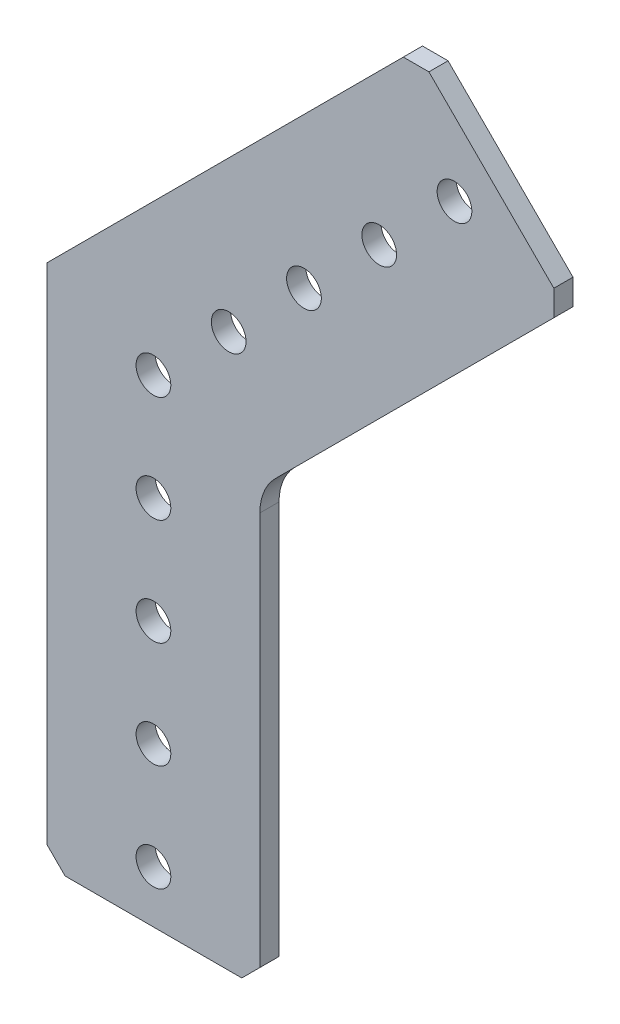
ISO-10303-21;
HEADER;
FILE_DESCRIPTION(('STEP AP214'),'2;1');
FILE_NAME('part.step','',(''),(''),'','','');
FILE_SCHEMA(('AUTOMOTIVE_DESIGN { 1 0 10303 214 1 1 1 1 }'));
ENDSEC;
DATA;
#1=APPLICATION_CONTEXT('core data for automotive mechanical design processes');
#2=APPLICATION_PROTOCOL_DEFINITION('international standard','automotive_design',2000,#1);
#3=PRODUCT_CONTEXT('',#1,'mechanical');
#4=PRODUCT('Part','Part','',(#3));
#5=PRODUCT_RELATED_PRODUCT_CATEGORY('part','',(#4));
#6=PRODUCT_DEFINITION_FORMATION('','',#4);
#7=PRODUCT_DEFINITION_CONTEXT('part definition',#1,'design');
#8=PRODUCT_DEFINITION('design','',#6,#7);
#9=PRODUCT_DEFINITION_SHAPE('','',#8);
#10=(LENGTH_UNIT() NAMED_UNIT(*) SI_UNIT(.MILLI.,.METRE.));
#11=(NAMED_UNIT(*) PLANE_ANGLE_UNIT() SI_UNIT($,.RADIAN.));
#12=(NAMED_UNIT(*) SI_UNIT($,.STERADIAN.) SOLID_ANGLE_UNIT());
#13=UNCERTAINTY_MEASURE_WITH_UNIT(LENGTH_MEASURE(1.E-05),#10,'distance_accuracy_value','');
#14=(GEOMETRIC_REPRESENTATION_CONTEXT(3) GLOBAL_UNCERTAINTY_ASSIGNED_CONTEXT((#13)) GLOBAL_UNIT_ASSIGNED_CONTEXT((#10,
#11,#12)) REPRESENTATION_CONTEXT('',''));
#15=CARTESIAN_POINT('',(0.,0.,0.));
#16=DIRECTION('',(0.,0.,1.));
#17=DIRECTION('',(1.,0.,0.));
#18=AXIS2_PLACEMENT_3D('',#15,#16,#17);
#19=CARTESIAN_POINT('',(47.7749625640879,32.8677374031131,0.));
#20=DIRECTION('',(0.707106781186547,0.707106781186548,0.));
#21=DIRECTION('',(-0.707106781186548,0.707106781186547,0.));
#22=AXIS2_PLACEMENT_3D('',#19,#20,#21);
#23=PLANE('',#22);
#24=DIRECTION('',(-0.707106781186548,0.707106781186547,0.));
#25=VECTOR('',#24,1.);
#26=CARTESIAN_POINT('',(47.7749625640879,32.8677374031131,2.286));
#27=LINE('',#26,#25);
#28=CARTESIAN_POINT('',(47.7749625640879,32.8677374031131,2.286));
#29=VERTEX_POINT('',#28);
#30=CARTESIAN_POINT('',(32.8677374031131,47.7749625640879,2.286));
#31=VERTEX_POINT('',#30);
#32=EDGE_CURVE('E147',#29,#31,#27,.T.);
#33=ORIENTED_EDGE('',*,*,#32,.F.);
#34=DIRECTION('',(0.,0.,1.));
#35=VECTOR('',#34,1.);
#36=CARTESIAN_POINT('',(47.7749625640879,32.8677374031131,0.));
#37=LINE('',#36,#35);
#38=CARTESIAN_POINT('',(47.7749625640879,32.8677374031131,0.));
#39=VERTEX_POINT('',#38);
#40=EDGE_CURVE('E11',#39,#29,#37,.T.);
#41=ORIENTED_EDGE('',*,*,#40,.F.);
#42=DIRECTION('',(-0.707106781186548,0.707106781186547,0.));
#43=VECTOR('',#42,1.);
#44=CARTESIAN_POINT('',(47.7749625640879,32.8677374031131,0.));
#45=LINE('',#44,#43);
#46=CARTESIAN_POINT('',(32.8677374031131,47.7749625640879,0.));
#47=VERTEX_POINT('',#46);
#48=EDGE_CURVE('E177',#39,#47,#45,.T.);
#49=ORIENTED_EDGE('',*,*,#48,.T.);
#50=DIRECTION('',(0.,0.,1.));
#51=VECTOR('',#50,1.);
#52=CARTESIAN_POINT('',(32.8677374031131,47.7749625640879,0.));
#53=LINE('',#52,#51);
#54=EDGE_CURVE('E35',#47,#31,#53,.T.);
#55=ORIENTED_EDGE('',*,*,#54,.T.);
#56=EDGE_LOOP('',(#33,#41,#49,#55));
#57=FACE_BOUND('',#56,.T.);
#58=ADVANCED_FACE('F32',(#57),#23,.T.);
#59=CARTESIAN_POINT('',(47.7749625640879,29.8144503219496,0.));
#60=DIRECTION('',(1.,0.,0.));
#61=DIRECTION('',(0.,1.,0.));
#62=AXIS2_PLACEMENT_3D('',#59,#60,#61);
#63=PLANE('',#62);
#64=DIRECTION('',(0.,1.,0.));
#65=VECTOR('',#64,1.);
#66=CARTESIAN_POINT('',(47.7749625640879,29.8144503219496,2.286));
#67=LINE('',#66,#65);
#68=CARTESIAN_POINT('',(47.7749625640879,29.8144503219496,2.286));
#69=VERTEX_POINT('',#68);
#70=EDGE_CURVE('E175',#69,#29,#67,.T.);
#71=ORIENTED_EDGE('',*,*,#70,.F.);
#72=DIRECTION('',(0.,0.,1.));
#73=VECTOR('',#72,1.);
#74=CARTESIAN_POINT('',(47.7749625640879,29.8144503219496,0.));
#75=LINE('',#74,#73);
#76=CARTESIAN_POINT('',(47.7749625640879,29.8144503219496,0.));
#77=VERTEX_POINT('',#76);
#78=EDGE_CURVE('E41',#77,#69,#75,.T.);
#79=ORIENTED_EDGE('',*,*,#78,.F.);
#80=DIRECTION('',(0.,1.,0.));
#81=VECTOR('',#80,1.);
#82=CARTESIAN_POINT('',(47.7749625640879,29.8144503219496,0.));
#83=LINE('',#82,#81);
#84=EDGE_CURVE('E137',#77,#39,#83,.T.);
#85=ORIENTED_EDGE('',*,*,#84,.T.);
#86=ORIENTED_EDGE('',*,*,#40,.T.);
#87=EDGE_LOOP('',(#71,#79,#85,#86));
#88=FACE_BOUND('',#87,.T.);
#89=ADVANCED_FACE('F195',(#88),#63,.T.);
#90=CARTESIAN_POINT('',(14.5598719394654,-3.40064030267288,0.));
#91=DIRECTION('',(0.707106781186548,-0.707106781186547,0.));
#92=DIRECTION('',(0.707106781186547,0.707106781186548,0.));
#93=AXIS2_PLACEMENT_3D('',#90,#91,#92);
#94=PLANE('',#93);
#95=DIRECTION('',(0.707106781186547,0.707106781186548,0.));
#96=VECTOR('',#95,1.);
#97=CARTESIAN_POINT('',(14.5598719394654,-3.40064030267288,2.286));
#98=LINE('',#97,#96);
#99=CARTESIAN_POINT('',(14.5598719394654,-3.40064030267288,2.286));
#100=VERTEX_POINT('',#99);
#101=EDGE_CURVE('E124',#100,#69,#98,.T.);
#102=ORIENTED_EDGE('',*,*,#101,.F.);
#103=DIRECTION('',(0.,0.,1.));
#104=VECTOR('',#103,1.);
#105=CARTESIAN_POINT('',(14.5598719394654,-3.40064030267288,0.));
#106=LINE('',#105,#104);
#107=CARTESIAN_POINT('',(14.5598719394654,-3.40064030267288,0.));
#108=VERTEX_POINT('',#107);
#109=EDGE_CURVE('E119',#108,#100,#106,.T.);
#110=ORIENTED_EDGE('',*,*,#109,.F.);
#111=DIRECTION('',(0.707106781186547,0.707106781186548,0.));
#112=VECTOR('',#111,1.);
#113=CARTESIAN_POINT('',(14.5598719394654,-3.40064030267288,0.));
#114=LINE('',#113,#112);
#115=EDGE_CURVE('E122',#108,#77,#114,.T.);
#116=ORIENTED_EDGE('',*,*,#115,.T.);
#117=ORIENTED_EDGE('',*,*,#78,.T.);
#118=EDGE_LOOP('',(#102,#110,#116,#117));
#119=FACE_BOUND('',#118,.T.);
#120=ADVANCED_FACE('F121',(#119),#94,.T.);
#121=CARTESIAN_POINT('',(19.05,-7.89076836320745,0.));
#122=DIRECTION('',(0.,0.,1.));
#123=DIRECTION('',(1.,0.,0.));
#124=AXIS2_PLACEMENT_3D('',#121,#122,#123);
#125=CYLINDRICAL_SURFACE('',#124,6.35);
#126=CARTESIAN_POINT('',(19.05,-7.89076836320745,2.286));
#127=DIRECTION('',(0.,0.,-1.));
#128=DIRECTION('',(-1.,0.,0.));
#129=AXIS2_PLACEMENT_3D('',#126,#127,#128);
#130=CIRCLE('',#129,6.35);
#131=CARTESIAN_POINT('',(12.7,-7.89076836320745,2.286));
#132=VERTEX_POINT('',#131);
#133=EDGE_CURVE('E172',#132,#100,#130,.T.);
#134=ORIENTED_EDGE('',*,*,#133,.F.);
#135=DIRECTION('',(0.,0.,1.));
#136=VECTOR('',#135,1.);
#137=CARTESIAN_POINT('',(12.7,-7.89076836320745,0.));
#138=LINE('',#137,#136);
#139=CARTESIAN_POINT('',(12.7,-7.89076836320745,0.));
#140=VERTEX_POINT('',#139);
#141=EDGE_CURVE('E129',#140,#132,#138,.T.);
#142=ORIENTED_EDGE('',*,*,#141,.F.);
#143=CARTESIAN_POINT('',(19.05,-7.89076836320745,0.));
#144=DIRECTION('',(0.,0.,-1.));
#145=DIRECTION('',(-1.,0.,0.));
#146=AXIS2_PLACEMENT_3D('',#143,#144,#145);
#147=CIRCLE('',#146,6.35);
#148=EDGE_CURVE('E135',#140,#108,#147,.T.);
#149=ORIENTED_EDGE('',*,*,#148,.T.);
#150=ORIENTED_EDGE('',*,*,#109,.T.);
#151=EDGE_LOOP('',(#134,#142,#149,#150));
#152=FACE_BOUND('',#151,.T.);
#153=ADVANCED_FACE('F139',(#152),#125,.F.);
#154=CARTESIAN_POINT('',(12.7,-54.864,0.));
#155=DIRECTION('',(1.,0.,0.));
#156=DIRECTION('',(0.,1.,0.));
#157=AXIS2_PLACEMENT_3D('',#154,#155,#156);
#158=PLANE('',#157);
#159=DIRECTION('',(0.,1.,0.));
#160=VECTOR('',#159,1.);
#161=CARTESIAN_POINT('',(12.7,-54.864,2.286));
#162=LINE('',#161,#160);
#163=CARTESIAN_POINT('',(12.7,-54.864,2.286));
#164=VERTEX_POINT('',#163);
#165=EDGE_CURVE('E169',#164,#132,#162,.T.);
#166=ORIENTED_EDGE('',*,*,#165,.F.);
#167=DIRECTION('',(0.,0.,1.));
#168=VECTOR('',#167,1.);
#169=CARTESIAN_POINT('',(12.7,-54.864,0.));
#170=LINE('',#169,#168);
#171=CARTESIAN_POINT('',(12.7,-54.864,0.));
#172=VERTEX_POINT('',#171);
#173=EDGE_CURVE('E181',#172,#164,#170,.T.);
#174=ORIENTED_EDGE('',*,*,#173,.F.);
#175=DIRECTION('',(0.,1.,0.));
#176=VECTOR('',#175,1.);
#177=CARTESIAN_POINT('',(12.7,-54.864,0.));
#178=LINE('',#177,#176);
#179=EDGE_CURVE('E140',#172,#140,#178,.T.);
#180=ORIENTED_EDGE('',*,*,#179,.T.);
#181=ORIENTED_EDGE('',*,*,#141,.T.);
#182=EDGE_LOOP('',(#166,#174,#180,#181));
#183=FACE_BOUND('',#182,.T.);
#184=ADVANCED_FACE('F208',(#183),#158,.T.);
#185=CARTESIAN_POINT('',(10.541,-57.023,0.));
#186=DIRECTION('',(0.70710678118655,-0.707106781186545,0.));
#187=DIRECTION('',(0.707106781186545,0.70710678118655,0.));
#188=AXIS2_PLACEMENT_3D('',#185,#186,#187);
#189=PLANE('',#188);
#190=DIRECTION('',(0.707106781186545,0.70710678118655,0.));
#191=VECTOR('',#190,1.);
#192=CARTESIAN_POINT('',(10.541,-57.023,2.286));
#193=LINE('',#192,#191);
#194=CARTESIAN_POINT('',(10.541,-57.023,2.286));
#195=VERTEX_POINT('',#194);
#196=EDGE_CURVE('E166',#195,#164,#193,.T.);
#197=ORIENTED_EDGE('',*,*,#196,.F.);
#198=DIRECTION('',(0.,0.,1.));
#199=VECTOR('',#198,1.);
#200=CARTESIAN_POINT('',(10.541,-57.023,0.));
#201=LINE('',#200,#199);
#202=CARTESIAN_POINT('',(10.541,-57.023,0.));
#203=VERTEX_POINT('',#202);
#204=EDGE_CURVE('E183',#203,#195,#201,.T.);
#205=ORIENTED_EDGE('',*,*,#204,.F.);
#206=DIRECTION('',(0.707106781186545,0.70710678118655,0.));
#207=VECTOR('',#206,1.);
#208=CARTESIAN_POINT('',(10.541,-57.023,0.));
#209=LINE('',#208,#207);
#210=EDGE_CURVE('E142',#203,#172,#209,.T.);
#211=ORIENTED_EDGE('',*,*,#210,.T.);
#212=ORIENTED_EDGE('',*,*,#173,.T.);
#213=EDGE_LOOP('',(#197,#205,#211,#212));
#214=FACE_BOUND('',#213,.T.);
#215=ADVANCED_FACE('F211',(#214),#189,.T.);
#216=CARTESIAN_POINT('',(-10.541,-57.023,0.));
#217=DIRECTION('',(0.,-1.,0.));
#218=DIRECTION('',(1.,0.,0.));
#219=AXIS2_PLACEMENT_3D('',#216,#217,#218);
#220=PLANE('',#219);
#221=DIRECTION('',(1.,0.,0.));
#222=VECTOR('',#221,1.);
#223=CARTESIAN_POINT('',(-10.541,-57.023,2.286));
#224=LINE('',#223,#222);
#225=CARTESIAN_POINT('',(-10.541,-57.023,2.286));
#226=VERTEX_POINT('',#225);
#227=EDGE_CURVE('E163',#226,#195,#224,.T.);
#228=ORIENTED_EDGE('',*,*,#227,.F.);
#229=DIRECTION('',(0.,0.,1.));
#230=VECTOR('',#229,1.);
#231=CARTESIAN_POINT('',(-10.541,-57.023,0.));
#232=LINE('',#231,#230);
#233=CARTESIAN_POINT('',(-10.541,-57.023,0.));
#234=VERTEX_POINT('',#233);
#235=EDGE_CURVE('E185',#234,#226,#232,.T.);
#236=ORIENTED_EDGE('',*,*,#235,.F.);
#237=DIRECTION('',(1.,0.,0.));
#238=VECTOR('',#237,1.);
#239=CARTESIAN_POINT('',(-10.541,-57.023,0.));
#240=LINE('',#239,#238);
#241=EDGE_CURVE('E348',#234,#203,#240,.T.);
#242=ORIENTED_EDGE('',*,*,#241,.T.);
#243=ORIENTED_EDGE('',*,*,#204,.T.);
#244=EDGE_LOOP('',(#228,#236,#242,#243));
#245=FACE_BOUND('',#244,.T.);
#246=ADVANCED_FACE('F215',(#245),#220,.T.);
#247=CARTESIAN_POINT('',(-12.7,-54.864,0.));
#248=DIRECTION('',(-0.707106781186549,-0.707106781186546,0.));
#249=DIRECTION('',(0.707106781186546,-0.707106781186549,0.));
#250=AXIS2_PLACEMENT_3D('',#247,#248,#249);
#251=PLANE('',#250);
#252=DIRECTION('',(0.707106781186546,-0.707106781186549,0.));
#253=VECTOR('',#252,1.);
#254=CARTESIAN_POINT('',(-12.7,-54.864,2.286));
#255=LINE('',#254,#253);
#256=CARTESIAN_POINT('',(-12.7,-54.864,2.286));
#257=VERTEX_POINT('',#256);
#258=EDGE_CURVE('E160',#257,#226,#255,.T.);
#259=ORIENTED_EDGE('',*,*,#258,.F.);
#260=DIRECTION('',(0.,0.,1.));
#261=VECTOR('',#260,1.);
#262=CARTESIAN_POINT('',(-12.7,-54.864,0.));
#263=LINE('',#262,#261);
#264=CARTESIAN_POINT('',(-12.7,-54.864,0.));
#265=VERTEX_POINT('',#264);
#266=EDGE_CURVE('E187',#265,#257,#263,.T.);
#267=ORIENTED_EDGE('',*,*,#266,.F.);
#268=DIRECTION('',(0.707106781186546,-0.707106781186549,0.));
#269=VECTOR('',#268,1.);
#270=CARTESIAN_POINT('',(-12.7,-54.864,0.));
#271=LINE('',#270,#269);
#272=EDGE_CURVE('E345',#265,#234,#271,.T.);
#273=ORIENTED_EDGE('',*,*,#272,.T.);
#274=ORIENTED_EDGE('',*,*,#235,.T.);
#275=EDGE_LOOP('',(#259,#267,#273,#274));
#276=FACE_BOUND('',#275,.T.);
#277=ADVANCED_FACE('F219',(#276),#251,.T.);
#278=CARTESIAN_POINT('',(-12.7,5.26051224213831,0.));
#279=DIRECTION('',(-1.,0.,0.));
#280=DIRECTION('',(0.,0.,1.));
#281=AXIS2_PLACEMENT_3D('',#278,#279,#280);
#282=PLANE('',#281);
#283=DIRECTION('',(0.,-1.,0.));
#284=VECTOR('',#283,1.);
#285=CARTESIAN_POINT('',(-12.7,5.26051224213831,2.286));
#286=LINE('',#285,#284);
#287=CARTESIAN_POINT('',(-12.7,5.26051224213831,2.286));
#288=VERTEX_POINT('',#287);
#289=EDGE_CURVE('E157',#288,#257,#286,.T.);
#290=ORIENTED_EDGE('',*,*,#289,.F.);
#291=DIRECTION('',(0.,0.,1.));
#292=VECTOR('',#291,1.);
#293=CARTESIAN_POINT('',(-12.7,5.26051224213831,0.));
#294=LINE('',#293,#292);
#295=CARTESIAN_POINT('',(-12.7,5.26051224213831,0.));
#296=VERTEX_POINT('',#295);
#297=EDGE_CURVE('E189',#296,#288,#294,.T.);
#298=ORIENTED_EDGE('',*,*,#297,.F.);
#299=DIRECTION('',(0.,-1.,0.));
#300=VECTOR('',#299,1.);
#301=CARTESIAN_POINT('',(-12.7,5.26051224213831,0.));
#302=LINE('',#301,#300);
#303=EDGE_CURVE('E342',#296,#265,#302,.T.);
#304=ORIENTED_EDGE('',*,*,#303,.T.);
#305=ORIENTED_EDGE('',*,*,#266,.T.);
#306=EDGE_LOOP('',(#290,#298,#304,#305));
#307=FACE_BOUND('',#306,.T.);
#308=ADVANCED_FACE('F223',(#307),#282,.T.);
#309=CARTESIAN_POINT('',(29.8144503219496,47.7749625640879,0.));
#310=DIRECTION('',(-0.707106781186548,0.707106781186547,0.));
#311=DIRECTION('',(-0.707106781186547,-0.707106781186548,0.));
#312=AXIS2_PLACEMENT_3D('',#309,#310,#311);
#313=PLANE('',#312);
#314=DIRECTION('',(-0.707106781186547,-0.707106781186548,0.));
#315=VECTOR('',#314,1.);
#316=CARTESIAN_POINT('',(29.8144503219496,47.7749625640879,2.286));
#317=LINE('',#316,#315);
#318=CARTESIAN_POINT('',(29.8144503219496,47.7749625640879,2.286));
#319=VERTEX_POINT('',#318);
#320=EDGE_CURVE('E154',#319,#288,#317,.T.);
#321=ORIENTED_EDGE('',*,*,#320,.F.);
#322=DIRECTION('',(0.,0.,1.));
#323=VECTOR('',#322,1.);
#324=CARTESIAN_POINT('',(29.8144503219496,47.7749625640879,0.));
#325=LINE('',#324,#323);
#326=CARTESIAN_POINT('',(29.8144503219496,47.7749625640879,0.));
#327=VERTEX_POINT('',#326);
#328=EDGE_CURVE('E190',#327,#319,#325,.T.);
#329=ORIENTED_EDGE('',*,*,#328,.F.);
#330=DIRECTION('',(-0.707106781186547,-0.707106781186548,0.));
#331=VECTOR('',#330,1.);
#332=CARTESIAN_POINT('',(29.8144503219496,47.7749625640879,0.));
#333=LINE('',#332,#331);
#334=EDGE_CURVE('E339',#327,#296,#333,.T.);
#335=ORIENTED_EDGE('',*,*,#334,.T.);
#336=ORIENTED_EDGE('',*,*,#297,.T.);
#337=EDGE_LOOP('',(#321,#329,#335,#336));
#338=FACE_BOUND('',#337,.T.);
#339=ADVANCED_FACE('F227',(#338),#313,.T.);
#340=CARTESIAN_POINT('',(32.8677374031131,47.7749625640879,0.));
#341=DIRECTION('',(0.,1.,0.));
#342=DIRECTION('',(0.,0.,1.));
#343=AXIS2_PLACEMENT_3D('',#340,#341,#342);
#344=PLANE('',#343);
#345=DIRECTION('',(-1.,0.,0.));
#346=VECTOR('',#345,1.);
#347=CARTESIAN_POINT('',(32.8677374031131,47.7749625640879,2.286));
#348=LINE('',#347,#346);
#349=EDGE_CURVE('E150',#31,#319,#348,.T.);
#350=ORIENTED_EDGE('',*,*,#349,.F.);
#351=ORIENTED_EDGE('',*,*,#54,.F.);
#352=DIRECTION('',(-1.,0.,0.));
#353=VECTOR('',#352,1.);
#354=CARTESIAN_POINT('',(32.8677374031131,47.7749625640879,0.));
#355=LINE('',#354,#353);
#356=EDGE_CURVE('E337',#47,#327,#355,.T.);
#357=ORIENTED_EDGE('',*,*,#356,.T.);
#358=ORIENTED_EDGE('',*,*,#328,.T.);
#359=EDGE_LOOP('',(#350,#351,#357,#358));
#360=FACE_BOUND('',#359,.T.);
#361=ADVANCED_FACE('F192',(#360),#344,.T.);
#362=CARTESIAN_POINT('',(19.05,-7.89076836320745,0.));
#363=DIRECTION('',(0.,0.,-1.));
#364=DIRECTION('',(-1.,0.,0.));
#365=AXIS2_PLACEMENT_3D('',#362,#363,#364);
#366=PLANE('',#365);
#367=CARTESIAN_POINT('',(0.,0.,0.));
#368=DIRECTION('',(0.,0.,1.));
#369=DIRECTION('',(-1.,0.,0.));
#370=AXIS2_PLACEMENT_3D('',#367,#368,#369);
#371=CIRCLE('',#370,2.0701);
#372=CARTESIAN_POINT('',(-2.0701,0.,0.));
#373=VERTEX_POINT('',#372);
#374=EDGE_CURVE('E282',#373,#373,#371,.T.);
#375=ORIENTED_EDGE('',*,*,#374,.T.);
#376=EDGE_LOOP('',(#375));
#377=FACE_BOUND('',#376,.T.);
#378=CARTESIAN_POINT('',(3.9907631702977E-13,-38.1,0.));
#379=DIRECTION('',(0.,0.,1.));
#380=DIRECTION('',(-1.,0.,0.));
#381=AXIS2_PLACEMENT_3D('',#378,#379,#380);
#382=CIRCLE('',#381,2.0701);
#383=CARTESIAN_POINT('',(-2.0700999999996,-38.1,0.));
#384=VERTEX_POINT('',#383);
#385=EDGE_CURVE('E290',#384,#384,#382,.T.);
#386=ORIENTED_EDGE('',*,*,#385,.T.);
#387=EDGE_LOOP('',(#386));
#388=FACE_BOUND('',#387,.T.);
#389=CARTESIAN_POINT('',(1.33025439009923E-13,-12.7,0.));
#390=DIRECTION('',(0.,0.,1.));
#391=DIRECTION('',(-1.,0.,0.));
#392=AXIS2_PLACEMENT_3D('',#389,#390,#391);
#393=CIRCLE('',#392,2.0701);
#394=CARTESIAN_POINT('',(-2.07009999999987,-12.7,0.));
#395=VERTEX_POINT('',#394);
#396=EDGE_CURVE('E296',#395,#395,#393,.T.);
#397=ORIENTED_EDGE('',*,*,#396,.T.);
#398=EDGE_LOOP('',(#397));
#399=FACE_BOUND('',#398,.T.);
#400=CARTESIAN_POINT('',(2.66050878019847E-13,-25.4,0.));
#401=DIRECTION('',(0.,0.,1.));
#402=DIRECTION('',(-1.,0.,0.));
#403=AXIS2_PLACEMENT_3D('',#400,#401,#402);
#404=CIRCLE('',#403,2.0701);
#405=CARTESIAN_POINT('',(-2.07009999999973,-25.4,0.));
#406=VERTEX_POINT('',#405);
#407=EDGE_CURVE('E302',#406,#406,#404,.T.);
#408=ORIENTED_EDGE('',*,*,#407,.T.);
#409=EDGE_LOOP('',(#408));
#410=FACE_BOUND('',#409,.T.);
#411=CARTESIAN_POINT('',(0.,-50.8,0.));
#412=DIRECTION('',(0.,0.,1.));
#413=DIRECTION('',(-1.,0.,0.));
#414=AXIS2_PLACEMENT_3D('',#411,#412,#413);
#415=CIRCLE('',#414,2.0701);
#416=CARTESIAN_POINT('',(-2.07009999999999,-50.8,0.));
#417=VERTEX_POINT('',#416);
#418=EDGE_CURVE('E308',#417,#417,#415,.T.);
#419=ORIENTED_EDGE('',*,*,#418,.T.);
#420=EDGE_LOOP('',(#419));
#421=FACE_BOUND('',#420,.T.);
#422=CARTESIAN_POINT('',(26.9407683632077,26.9407683632072,0.));
#423=DIRECTION('',(0.,0.,1.));
#424=DIRECTION('',(-1.,0.,0.));
#425=AXIS2_PLACEMENT_3D('',#422,#423,#424);
#426=CIRCLE('',#425,2.0701);
#427=CARTESIAN_POINT('',(24.8706683632077,26.9407683632072,0.));
#428=VERTEX_POINT('',#427);
#429=EDGE_CURVE('E314',#428,#428,#426,.T.);
#430=ORIENTED_EDGE('',*,*,#429,.T.);
#431=EDGE_LOOP('',(#430));
#432=FACE_BOUND('',#431,.T.);
#433=CARTESIAN_POINT('',(8.98025612106925,8.98025612106906,0.));
#434=DIRECTION('',(0.,0.,1.));
#435=DIRECTION('',(-1.,0.,0.));
#436=AXIS2_PLACEMENT_3D('',#433,#434,#435);
#437=CIRCLE('',#436,2.0701);
#438=CARTESIAN_POINT('',(6.91015612106925,8.98025612106906,0.));
#439=VERTEX_POINT('',#438);
#440=EDGE_CURVE('E320',#439,#439,#437,.T.);
#441=ORIENTED_EDGE('',*,*,#440,.T.);
#442=EDGE_LOOP('',(#441));
#443=FACE_BOUND('',#442,.T.);
#444=CARTESIAN_POINT('',(17.9605122421385,17.9605122421381,0.));
#445=DIRECTION('',(0.,0.,1.));
#446=DIRECTION('',(-1.,0.,0.));
#447=AXIS2_PLACEMENT_3D('',#444,#445,#446);
#448=CIRCLE('',#447,2.0701);
#449=CARTESIAN_POINT('',(15.8904122421385,17.9605122421381,0.));
#450=VERTEX_POINT('',#449);
#451=EDGE_CURVE('E326',#450,#450,#448,.T.);
#452=ORIENTED_EDGE('',*,*,#451,.T.);
#453=EDGE_LOOP('',(#452));
#454=FACE_BOUND('',#453,.T.);
#455=CARTESIAN_POINT('',(35.9210244842766,35.9210244842766,0.));
#456=DIRECTION('',(0.,0.,1.));
#457=DIRECTION('',(-1.,0.,0.));
#458=AXIS2_PLACEMENT_3D('',#455,#456,#457);
#459=CIRCLE('',#458,2.07010000000001);
#460=CARTESIAN_POINT('',(33.8509244842766,35.9210244842766,0.));
#461=VERTEX_POINT('',#460);
#462=EDGE_CURVE('E151',#461,#461,#459,.T.);
#463=ORIENTED_EDGE('',*,*,#462,.T.);
#464=EDGE_LOOP('',(#463));
#465=FACE_BOUND('',#464,.T.);
#466=ORIENTED_EDGE('',*,*,#48,.F.);
#467=ORIENTED_EDGE('',*,*,#84,.F.);
#468=ORIENTED_EDGE('',*,*,#115,.F.);
#469=ORIENTED_EDGE('',*,*,#148,.F.);
#470=ORIENTED_EDGE('',*,*,#179,.F.);
#471=ORIENTED_EDGE('',*,*,#210,.F.);
#472=ORIENTED_EDGE('',*,*,#241,.F.);
#473=ORIENTED_EDGE('',*,*,#272,.F.);
#474=ORIENTED_EDGE('',*,*,#303,.F.);
#475=ORIENTED_EDGE('',*,*,#334,.F.);
#476=ORIENTED_EDGE('',*,*,#356,.F.);
#477=EDGE_LOOP('',(#466,#467,#468,#469,#470,#471,#472,#473,#474,#475,#476));
#478=FACE_BOUND('',#477,.T.);
#479=ADVANCED_FACE('F133',(#377,#388,#399,#410,#421,#432,#443,#454,#465,#478),#366,.T.);
#480=CARTESIAN_POINT('',(19.05,-7.89076836320745,2.286));
#481=DIRECTION('',(0.,0.,-1.));
#482=DIRECTION('',(-1.,0.,0.));
#483=AXIS2_PLACEMENT_3D('',#480,#481,#482);
#484=PLANE('',#483);
#485=CARTESIAN_POINT('',(0.,0.,2.286));
#486=DIRECTION('',(0.,0.,1.));
#487=DIRECTION('',(-1.,0.,0.));
#488=AXIS2_PLACEMENT_3D('',#485,#486,#487);
#489=CIRCLE('',#488,2.0701);
#490=CARTESIAN_POINT('',(-2.0701,0.,2.286));
#491=VERTEX_POINT('',#490);
#492=EDGE_CURVE('E285',#491,#491,#489,.T.);
#493=ORIENTED_EDGE('',*,*,#492,.F.);
#494=EDGE_LOOP('',(#493));
#495=FACE_BOUND('',#494,.T.);
#496=CARTESIAN_POINT('',(3.9907631702977E-13,-38.1,2.286));
#497=DIRECTION('',(0.,0.,1.));
#498=DIRECTION('',(-1.,0.,0.));
#499=AXIS2_PLACEMENT_3D('',#496,#497,#498);
#500=CIRCLE('',#499,2.0701);
#501=CARTESIAN_POINT('',(-2.0700999999996,-38.1,2.286));
#502=VERTEX_POINT('',#501);
#503=EDGE_CURVE('E287',#502,#502,#500,.T.);
#504=ORIENTED_EDGE('',*,*,#503,.F.);
#505=EDGE_LOOP('',(#504));
#506=FACE_BOUND('',#505,.T.);
#507=CARTESIAN_POINT('',(1.33025439009923E-13,-12.7,2.286));
#508=DIRECTION('',(0.,0.,1.));
#509=DIRECTION('',(-1.,0.,0.));
#510=AXIS2_PLACEMENT_3D('',#507,#508,#509);
#511=CIRCLE('',#510,2.0701);
#512=CARTESIAN_POINT('',(-2.07009999999987,-12.7,2.286));
#513=VERTEX_POINT('',#512);
#514=EDGE_CURVE('E293',#513,#513,#511,.T.);
#515=ORIENTED_EDGE('',*,*,#514,.F.);
#516=EDGE_LOOP('',(#515));
#517=FACE_BOUND('',#516,.T.);
#518=CARTESIAN_POINT('',(2.66050878019847E-13,-25.4,2.286));
#519=DIRECTION('',(0.,0.,1.));
#520=DIRECTION('',(-1.,0.,0.));
#521=AXIS2_PLACEMENT_3D('',#518,#519,#520);
#522=CIRCLE('',#521,2.0701);
#523=CARTESIAN_POINT('',(-2.07009999999973,-25.4,2.286));
#524=VERTEX_POINT('',#523);
#525=EDGE_CURVE('E299',#524,#524,#522,.T.);
#526=ORIENTED_EDGE('',*,*,#525,.F.);
#527=EDGE_LOOP('',(#526));
#528=FACE_BOUND('',#527,.T.);
#529=CARTESIAN_POINT('',(0.,-50.8,2.286));
#530=DIRECTION('',(0.,0.,1.));
#531=DIRECTION('',(-1.,0.,0.));
#532=AXIS2_PLACEMENT_3D('',#529,#530,#531);
#533=CIRCLE('',#532,2.0701);
#534=CARTESIAN_POINT('',(-2.07009999999999,-50.8,2.286));
#535=VERTEX_POINT('',#534);
#536=EDGE_CURVE('E305',#535,#535,#533,.T.);
#537=ORIENTED_EDGE('',*,*,#536,.F.);
#538=EDGE_LOOP('',(#537));
#539=FACE_BOUND('',#538,.T.);
#540=CARTESIAN_POINT('',(26.9407683632077,26.9407683632072,2.286));
#541=DIRECTION('',(0.,0.,1.));
#542=DIRECTION('',(-1.,0.,0.));
#543=AXIS2_PLACEMENT_3D('',#540,#541,#542);
#544=CIRCLE('',#543,2.0701);
#545=CARTESIAN_POINT('',(24.8706683632077,26.9407683632072,2.286));
#546=VERTEX_POINT('',#545);
#547=EDGE_CURVE('E311',#546,#546,#544,.T.);
#548=ORIENTED_EDGE('',*,*,#547,.F.);
#549=EDGE_LOOP('',(#548));
#550=FACE_BOUND('',#549,.T.);
#551=CARTESIAN_POINT('',(8.98025612106925,8.98025612106906,2.286));
#552=DIRECTION('',(0.,0.,1.));
#553=DIRECTION('',(-1.,0.,0.));
#554=AXIS2_PLACEMENT_3D('',#551,#552,#553);
#555=CIRCLE('',#554,2.0701);
#556=CARTESIAN_POINT('',(6.91015612106925,8.98025612106906,2.286));
#557=VERTEX_POINT('',#556);
#558=EDGE_CURVE('E317',#557,#557,#555,.T.);
#559=ORIENTED_EDGE('',*,*,#558,.F.);
#560=EDGE_LOOP('',(#559));
#561=FACE_BOUND('',#560,.T.);
#562=CARTESIAN_POINT('',(17.9605122421385,17.9605122421381,2.286));
#563=DIRECTION('',(0.,0.,1.));
#564=DIRECTION('',(-1.,0.,0.));
#565=AXIS2_PLACEMENT_3D('',#562,#563,#564);
#566=CIRCLE('',#565,2.0701);
#567=CARTESIAN_POINT('',(15.8904122421385,17.9605122421381,2.286));
#568=VERTEX_POINT('',#567);
#569=EDGE_CURVE('E323',#568,#568,#566,.T.);
#570=ORIENTED_EDGE('',*,*,#569,.F.);
#571=EDGE_LOOP('',(#570));
#572=FACE_BOUND('',#571,.T.);
#573=CARTESIAN_POINT('',(35.9210244842766,35.9210244842766,2.286));
#574=DIRECTION('',(0.,0.,1.));
#575=DIRECTION('',(-1.,0.,0.));
#576=AXIS2_PLACEMENT_3D('',#573,#574,#575);
#577=CIRCLE('',#576,2.07010000000001);
#578=CARTESIAN_POINT('',(33.8509244842766,35.9210244842766,2.286));
#579=VERTEX_POINT('',#578);
#580=EDGE_CURVE('E329',#579,#579,#577,.T.);
#581=ORIENTED_EDGE('',*,*,#580,.F.);
#582=EDGE_LOOP('',(#581));
#583=FACE_BOUND('',#582,.T.);
#584=ORIENTED_EDGE('',*,*,#32,.T.);
#585=ORIENTED_EDGE('',*,*,#349,.T.);
#586=ORIENTED_EDGE('',*,*,#320,.T.);
#587=ORIENTED_EDGE('',*,*,#289,.T.);
#588=ORIENTED_EDGE('',*,*,#258,.T.);
#589=ORIENTED_EDGE('',*,*,#227,.T.);
#590=ORIENTED_EDGE('',*,*,#196,.T.);
#591=ORIENTED_EDGE('',*,*,#165,.T.);
#592=ORIENTED_EDGE('',*,*,#133,.T.);
#593=ORIENTED_EDGE('',*,*,#101,.T.);
#594=ORIENTED_EDGE('',*,*,#70,.T.);
#595=EDGE_LOOP('',(#584,#585,#586,#587,#588,#589,#590,#591,#592,#593,#594));
#596=FACE_BOUND('',#595,.T.);
#597=ADVANCED_FACE('F194',(#495,#506,#517,#528,#539,#550,#561,#572,#583,#596),#484,.F.);
#598=CARTESIAN_POINT('',(35.9210244842766,35.9210244842766,0.));
#599=DIRECTION('',(0.,0.,1.));
#600=DIRECTION('',(1.,0.,0.));
#601=AXIS2_PLACEMENT_3D('',#598,#599,#600);
#602=CYLINDRICAL_SURFACE('',#601,2.07010000000001);
#603=ORIENTED_EDGE('',*,*,#462,.F.);
#604=EDGE_LOOP('',(#603));
#605=FACE_BOUND('',#604,.T.);
#606=ORIENTED_EDGE('',*,*,#580,.T.);
#607=EDGE_LOOP('',(#606));
#608=FACE_BOUND('',#607,.T.);
#609=ADVANCED_FACE('F239',(#605,#608),#602,.F.);
#610=CARTESIAN_POINT('',(17.9605122421385,17.9605122421381,0.));
#611=DIRECTION('',(0.,0.,1.));
#612=DIRECTION('',(1.,0.,0.));
#613=AXIS2_PLACEMENT_3D('',#610,#611,#612);
#614=CYLINDRICAL_SURFACE('',#613,2.0701);
#615=ORIENTED_EDGE('',*,*,#451,.F.);
#616=EDGE_LOOP('',(#615));
#617=FACE_BOUND('',#616,.T.);
#618=ORIENTED_EDGE('',*,*,#569,.T.);
#619=EDGE_LOOP('',(#618));
#620=FACE_BOUND('',#619,.T.);
#621=ADVANCED_FACE('F246',(#617,#620),#614,.F.);
#622=CARTESIAN_POINT('',(8.98025612106925,8.98025612106906,0.));
#623=DIRECTION('',(0.,0.,1.));
#624=DIRECTION('',(1.,0.,0.));
#625=AXIS2_PLACEMENT_3D('',#622,#623,#624);
#626=CYLINDRICAL_SURFACE('',#625,2.0701);
#627=ORIENTED_EDGE('',*,*,#440,.F.);
#628=EDGE_LOOP('',(#627));
#629=FACE_BOUND('',#628,.T.);
#630=ORIENTED_EDGE('',*,*,#558,.T.);
#631=EDGE_LOOP('',(#630));
#632=FACE_BOUND('',#631,.T.);
#633=ADVANCED_FACE('F250',(#629,#632),#626,.F.);
#634=CARTESIAN_POINT('',(26.9407683632077,26.9407683632072,0.));
#635=DIRECTION('',(0.,0.,1.));
#636=DIRECTION('',(1.,0.,0.));
#637=AXIS2_PLACEMENT_3D('',#634,#635,#636);
#638=CYLINDRICAL_SURFACE('',#637,2.0701);
#639=ORIENTED_EDGE('',*,*,#429,.F.);
#640=EDGE_LOOP('',(#639));
#641=FACE_BOUND('',#640,.T.);
#642=ORIENTED_EDGE('',*,*,#547,.T.);
#643=EDGE_LOOP('',(#642));
#644=FACE_BOUND('',#643,.T.);
#645=ADVANCED_FACE('F254',(#641,#644),#638,.F.);
#646=CARTESIAN_POINT('',(0.,-50.8,0.));
#647=DIRECTION('',(0.,0.,1.));
#648=DIRECTION('',(1.,0.,0.));
#649=AXIS2_PLACEMENT_3D('',#646,#647,#648);
#650=CYLINDRICAL_SURFACE('',#649,2.0701);
#651=ORIENTED_EDGE('',*,*,#418,.F.);
#652=EDGE_LOOP('',(#651));
#653=FACE_BOUND('',#652,.T.);
#654=ORIENTED_EDGE('',*,*,#536,.T.);
#655=EDGE_LOOP('',(#654));
#656=FACE_BOUND('',#655,.T.);
#657=ADVANCED_FACE('F258',(#653,#656),#650,.F.);
#658=CARTESIAN_POINT('',(2.66050878019847E-13,-25.4,0.));
#659=DIRECTION('',(0.,0.,1.));
#660=DIRECTION('',(1.,0.,0.));
#661=AXIS2_PLACEMENT_3D('',#658,#659,#660);
#662=CYLINDRICAL_SURFACE('',#661,2.0701);
#663=ORIENTED_EDGE('',*,*,#407,.F.);
#664=EDGE_LOOP('',(#663));
#665=FACE_BOUND('',#664,.T.);
#666=ORIENTED_EDGE('',*,*,#525,.T.);
#667=EDGE_LOOP('',(#666));
#668=FACE_BOUND('',#667,.T.);
#669=ADVANCED_FACE('F262',(#665,#668),#662,.F.);
#670=CARTESIAN_POINT('',(1.33025439009923E-13,-12.7,0.));
#671=DIRECTION('',(0.,0.,1.));
#672=DIRECTION('',(1.,0.,0.));
#673=AXIS2_PLACEMENT_3D('',#670,#671,#672);
#674=CYLINDRICAL_SURFACE('',#673,2.0701);
#675=ORIENTED_EDGE('',*,*,#396,.F.);
#676=EDGE_LOOP('',(#675));
#677=FACE_BOUND('',#676,.T.);
#678=ORIENTED_EDGE('',*,*,#514,.T.);
#679=EDGE_LOOP('',(#678));
#680=FACE_BOUND('',#679,.T.);
#681=ADVANCED_FACE('F266',(#677,#680),#674,.F.);
#682=CARTESIAN_POINT('',(3.9907631702977E-13,-38.1,0.));
#683=DIRECTION('',(0.,0.,1.));
#684=DIRECTION('',(1.,0.,0.));
#685=AXIS2_PLACEMENT_3D('',#682,#683,#684);
#686=CYLINDRICAL_SURFACE('',#685,2.0701);
#687=ORIENTED_EDGE('',*,*,#385,.F.);
#688=EDGE_LOOP('',(#687));
#689=FACE_BOUND('',#688,.T.);
#690=ORIENTED_EDGE('',*,*,#503,.T.);
#691=EDGE_LOOP('',(#690));
#692=FACE_BOUND('',#691,.T.);
#693=ADVANCED_FACE('F270',(#689,#692),#686,.F.);
#694=CARTESIAN_POINT('',(0.,0.,0.));
#695=DIRECTION('',(0.,0.,1.));
#696=DIRECTION('',(1.,0.,0.));
#697=AXIS2_PLACEMENT_3D('',#694,#695,#696);
#698=CYLINDRICAL_SURFACE('',#697,2.0701);
#699=ORIENTED_EDGE('',*,*,#374,.F.);
#700=EDGE_LOOP('',(#699));
#701=FACE_BOUND('',#700,.T.);
#702=ORIENTED_EDGE('',*,*,#492,.T.);
#703=EDGE_LOOP('',(#702));
#704=FACE_BOUND('',#703,.T.);
#705=ADVANCED_FACE('F274',(#701,#704),#698,.F.);
#706=CLOSED_SHELL('',(#58,#89,#120,#153,#184,#215,#246,#277,#308,#339,#361,#479,#597,#609,#621,
#633,#645,#657,#669,#681,#693,#705));
#707=MANIFOLD_SOLID_BREP('B2',#706);
#708=ADVANCED_BREP_SHAPE_REPRESENTATION('',(#18,#707),#14);
#709=SHAPE_DEFINITION_REPRESENTATION(#9,#708);
ENDSEC;
END-ISO-10303-21;
